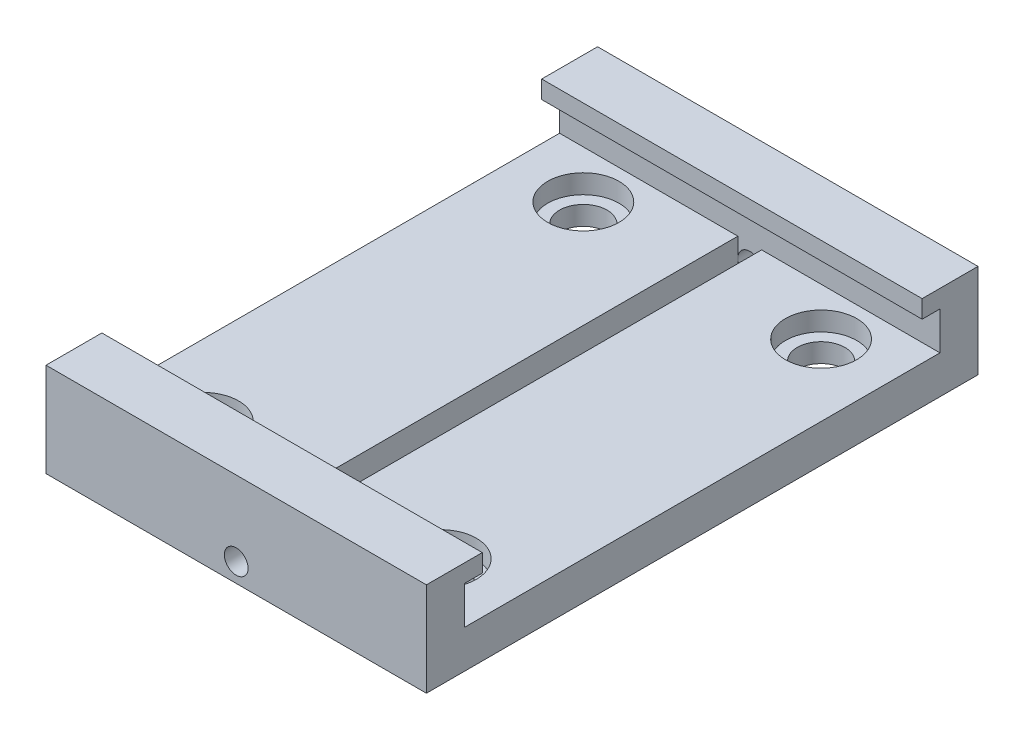
ISO-10303-21;
HEADER;
FILE_DESCRIPTION(('STEP AP214'),'2;1');
FILE_NAME('part.step','',(''),(''),'','','');
FILE_SCHEMA(('AUTOMOTIVE_DESIGN { 1 0 10303 214 1 1 1 1 }'));
ENDSEC;
DATA;
#1=APPLICATION_CONTEXT('core data for automotive mechanical design processes');
#2=APPLICATION_PROTOCOL_DEFINITION('international standard','automotive_design',2000,#1);
#3=PRODUCT_CONTEXT('',#1,'mechanical');
#4=PRODUCT('Part','Part','',(#3));
#5=PRODUCT_RELATED_PRODUCT_CATEGORY('part','',(#4));
#6=PRODUCT_DEFINITION_FORMATION('','',#4);
#7=PRODUCT_DEFINITION_CONTEXT('part definition',#1,'design');
#8=PRODUCT_DEFINITION('design','',#6,#7);
#9=PRODUCT_DEFINITION_SHAPE('','',#8);
#10=(LENGTH_UNIT() NAMED_UNIT(*) SI_UNIT(.MILLI.,.METRE.));
#11=(NAMED_UNIT(*) PLANE_ANGLE_UNIT() SI_UNIT($,.RADIAN.));
#12=(NAMED_UNIT(*) SI_UNIT($,.STERADIAN.) SOLID_ANGLE_UNIT());
#13=UNCERTAINTY_MEASURE_WITH_UNIT(LENGTH_MEASURE(1.E-05),#10,'distance_accuracy_value','');
#14=(GEOMETRIC_REPRESENTATION_CONTEXT(3) GLOBAL_UNCERTAINTY_ASSIGNED_CONTEXT((#13)) GLOBAL_UNIT_ASSIGNED_CONTEXT((#10,
#11,#12)) REPRESENTATION_CONTEXT('',''));
#15=CARTESIAN_POINT('',(0.,0.,0.));
#16=DIRECTION('',(0.,0.,1.));
#17=DIRECTION('',(1.,0.,0.));
#18=AXIS2_PLACEMENT_3D('',#15,#16,#17);
#19=CARTESIAN_POINT('',(-25.4,0.,-31.75));
#20=DIRECTION('',(0.,0.,1.));
#21=DIRECTION('',(1.,0.,0.));
#22=AXIS2_PLACEMENT_3D('',#19,#20,#21);
#23=PLANE('',#22);
#24=DIRECTION('',(0.,1.,0.));
#25=VECTOR('',#24,1.);
#26=CARTESIAN_POINT('',(1.5875,0.,-31.75));
#27=LINE('',#26,#25);
#28=CARTESIAN_POINT('',(1.5875,0.,-31.75));
#29=VERTEX_POINT('',#28);
#30=CARTESIAN_POINT('',(1.5875,2.54,-31.75));
#31=VERTEX_POINT('',#30);
#32=EDGE_CURVE('E170',#29,#31,#27,.T.);
#33=ORIENTED_EDGE('',*,*,#32,.T.);
#34=CARTESIAN_POINT('',(0.,2.54,-31.75));
#35=DIRECTION('',(0.,0.,1.));
#36=DIRECTION('',(1.,0.,0.));
#37=AXIS2_PLACEMENT_3D('',#34,#35,#36);
#38=CIRCLE('',#37,1.5875);
#39=CARTESIAN_POINT('',(-1.5875,2.54,-31.75));
#40=VERTEX_POINT('',#39);
#41=EDGE_CURVE('E50',#31,#40,#38,.F.);
#42=ORIENTED_EDGE('',*,*,#41,.T.);
#43=DIRECTION('',(0.,1.,0.));
#44=VECTOR('',#43,1.);
#45=CARTESIAN_POINT('',(-1.5875,0.,-31.75));
#46=LINE('',#45,#44);
#47=CARTESIAN_POINT('',(-1.5875,0.,-31.75));
#48=VERTEX_POINT('',#47);
#49=EDGE_CURVE('E168',#48,#40,#46,.T.);
#50=ORIENTED_EDGE('',*,*,#49,.F.);
#51=DIRECTION('',(-1.,0.,0.));
#52=VECTOR('',#51,1.);
#53=CARTESIAN_POINT('',(-1.5875,0.,-31.75));
#54=LINE('',#53,#52);
#55=EDGE_CURVE('E319',#29,#48,#54,.T.);
#56=ORIENTED_EDGE('',*,*,#55,.F.);
#57=EDGE_LOOP('',(#33,#42,#50,#56));
#58=FACE_BOUND('',#57,.T.);
#59=ADVANCED_FACE('F34',(#58),#23,.T.);
#60=CARTESIAN_POINT('',(-25.4,0.,31.75));
#61=DIRECTION('',(0.,0.,1.));
#62=DIRECTION('',(1.,0.,0.));
#63=AXIS2_PLACEMENT_3D('',#60,#61,#62);
#64=PLANE('',#63);
#65=DIRECTION('',(0.,1.,0.));
#66=VECTOR('',#65,1.);
#67=CARTESIAN_POINT('',(1.58750000000001,0.,31.75));
#68=LINE('',#67,#66);
#69=CARTESIAN_POINT('',(1.58750000000001,2.54,31.75));
#70=VERTEX_POINT('',#69);
#71=CARTESIAN_POINT('',(1.58750000000001,5.08,31.75));
#72=VERTEX_POINT('',#71);
#73=EDGE_CURVE('E197',#70,#72,#68,.T.);
#74=ORIENTED_EDGE('',*,*,#73,.F.);
#75=CARTESIAN_POINT('',(0.,2.54,31.75));
#76=DIRECTION('',(0.,0.,1.));
#77=DIRECTION('',(1.,0.,0.));
#78=AXIS2_PLACEMENT_3D('',#75,#76,#77);
#79=CIRCLE('',#78,1.5875);
#80=CARTESIAN_POINT('',(-1.58750000000001,2.54,31.75));
#81=VERTEX_POINT('',#80);
#82=EDGE_CURVE('E57',#81,#70,#79,.F.);
#83=ORIENTED_EDGE('',*,*,#82,.F.);
#84=DIRECTION('',(0.,1.,0.));
#85=VECTOR('',#84,1.);
#86=CARTESIAN_POINT('',(-1.58750000000001,0.,31.75));
#87=LINE('',#86,#85);
#88=CARTESIAN_POINT('',(-1.58750000000001,5.08,31.75));
#89=VERTEX_POINT('',#88);
#90=EDGE_CURVE('E201',#81,#89,#87,.T.);
#91=ORIENTED_EDGE('',*,*,#90,.T.);
#92=DIRECTION('',(1.,0.,0.));
#93=VECTOR('',#92,1.);
#94=CARTESIAN_POINT('',(-25.4,5.08,31.75));
#95=LINE('',#94,#93);
#96=CARTESIAN_POINT('',(-25.4,5.08,31.75));
#97=VERTEX_POINT('',#96);
#98=EDGE_CURVE('E251',#97,#89,#95,.T.);
#99=ORIENTED_EDGE('',*,*,#98,.F.);
#100=DIRECTION('',(0.,-1.,0.));
#101=VECTOR('',#100,1.);
#102=CARTESIAN_POINT('',(-25.4,0.,31.75));
#103=LINE('',#102,#101);
#104=CARTESIAN_POINT('',(-25.4,10.16,31.75));
#105=VERTEX_POINT('',#104);
#106=EDGE_CURVE('E224',#105,#97,#103,.T.);
#107=ORIENTED_EDGE('',*,*,#106,.F.);
#108=DIRECTION('',(1.,0.,0.));
#109=VECTOR('',#108,1.);
#110=CARTESIAN_POINT('',(-25.4,10.16,31.75));
#111=LINE('',#110,#109);
#112=CARTESIAN_POINT('',(25.4,10.16,31.75));
#113=VERTEX_POINT('',#112);
#114=EDGE_CURVE('E255',#105,#113,#111,.T.);
#115=ORIENTED_EDGE('',*,*,#114,.T.);
#116=DIRECTION('',(0.,-1.,0.));
#117=VECTOR('',#116,1.);
#118=CARTESIAN_POINT('',(25.4,0.,31.75));
#119=LINE('',#118,#117);
#120=CARTESIAN_POINT('',(25.4,5.08,31.75));
#121=VERTEX_POINT('',#120);
#122=EDGE_CURVE('E243',#113,#121,#119,.T.);
#123=ORIENTED_EDGE('',*,*,#122,.T.);
#124=EDGE_CURVE('E254',#72,#121,#95,.T.);
#125=ORIENTED_EDGE('',*,*,#124,.F.);
#126=EDGE_LOOP('',(#74,#83,#91,#99,#107,#115,#123,#125));
#127=FACE_BOUND('',#126,.T.);
#128=ADVANCED_FACE('F354',(#127),#64,.F.);
#129=CARTESIAN_POINT('',(15.875,0.,-25.4));
#130=DIRECTION('',(0.,1.,0.));
#131=DIRECTION('',(0.,0.,1.));
#132=AXIS2_PLACEMENT_3D('',#129,#130,#131);
#133=CYLINDRICAL_SURFACE('',#132,3.175);
#134=CARTESIAN_POINT('',(15.875,0.,-25.4));
#135=DIRECTION('',(0.,1.,0.));
#136=DIRECTION('',(0.,0.,1.));
#137=AXIS2_PLACEMENT_3D('',#134,#135,#136);
#138=CIRCLE('',#137,3.175);
#139=CARTESIAN_POINT('',(15.875,0.,-22.225));
#140=VERTEX_POINT('',#139);
#141=EDGE_CURVE('E308',#140,#140,#138,.T.);
#142=ORIENTED_EDGE('',*,*,#141,.F.);
#143=EDGE_LOOP('',(#142));
#144=FACE_BOUND('',#143,.T.);
#145=CARTESIAN_POINT('',(15.875,2.54,-25.4));
#146=DIRECTION('',(0.,1.,0.));
#147=DIRECTION('',(0.,0.,1.));
#148=AXIS2_PLACEMENT_3D('',#145,#146,#147);
#149=CIRCLE('',#148,3.175);
#150=CARTESIAN_POINT('',(15.875,2.54,-22.225));
#151=VERTEX_POINT('',#150);
#152=EDGE_CURVE('E38',#151,#151,#149,.F.);
#153=ORIENTED_EDGE('',*,*,#152,.F.);
#154=EDGE_LOOP('',(#153));
#155=FACE_BOUND('',#154,.T.);
#156=ADVANCED_FACE('F408',(#144,#155),#133,.F.);
#157=CARTESIAN_POINT('',(15.875,0.,25.4));
#158=DIRECTION('',(0.,1.,0.));
#159=DIRECTION('',(0.,0.,1.));
#160=AXIS2_PLACEMENT_3D('',#157,#158,#159);
#161=CYLINDRICAL_SURFACE('',#160,3.175);
#162=CARTESIAN_POINT('',(15.875,0.,25.4));
#163=DIRECTION('',(0.,1.,0.));
#164=DIRECTION('',(0.,0.,1.));
#165=AXIS2_PLACEMENT_3D('',#162,#163,#164);
#166=CIRCLE('',#165,3.175);
#167=CARTESIAN_POINT('',(15.875,0.,28.575));
#168=VERTEX_POINT('',#167);
#169=EDGE_CURVE('E295',#168,#168,#166,.T.);
#170=ORIENTED_EDGE('',*,*,#169,.F.);
#171=EDGE_LOOP('',(#170));
#172=FACE_BOUND('',#171,.T.);
#173=CARTESIAN_POINT('',(15.875,2.54,25.4));
#174=DIRECTION('',(0.,1.,0.));
#175=DIRECTION('',(0.,0.,1.));
#176=AXIS2_PLACEMENT_3D('',#173,#174,#175);
#177=CIRCLE('',#176,3.175);
#178=CARTESIAN_POINT('',(15.875,2.54,28.575));
#179=VERTEX_POINT('',#178);
#180=EDGE_CURVE('E290',#179,#179,#177,.F.);
#181=ORIENTED_EDGE('',*,*,#180,.F.);
#182=EDGE_LOOP('',(#181));
#183=FACE_BOUND('',#182,.T.);
#184=ADVANCED_FACE('F454',(#172,#183),#161,.F.);
#185=CARTESIAN_POINT('',(-15.875,0.,-25.4));
#186=DIRECTION('',(0.,1.,0.));
#187=DIRECTION('',(0.,0.,1.));
#188=AXIS2_PLACEMENT_3D('',#185,#186,#187);
#189=CYLINDRICAL_SURFACE('',#188,3.175);
#190=CARTESIAN_POINT('',(-15.875,0.,-25.4));
#191=DIRECTION('',(0.,1.,0.));
#192=DIRECTION('',(0.,0.,1.));
#193=AXIS2_PLACEMENT_3D('',#190,#191,#192);
#194=CIRCLE('',#193,3.175);
#195=CARTESIAN_POINT('',(-15.875,0.,-22.225));
#196=VERTEX_POINT('',#195);
#197=EDGE_CURVE('E304',#196,#196,#194,.T.);
#198=ORIENTED_EDGE('',*,*,#197,.F.);
#199=EDGE_LOOP('',(#198));
#200=FACE_BOUND('',#199,.T.);
#201=CARTESIAN_POINT('',(-15.875,2.54,-25.4));
#202=DIRECTION('',(0.,1.,0.));
#203=DIRECTION('',(0.,0.,1.));
#204=AXIS2_PLACEMENT_3D('',#201,#202,#203);
#205=CIRCLE('',#204,3.175);
#206=CARTESIAN_POINT('',(-15.875,2.54,-22.225));
#207=VERTEX_POINT('',#206);
#208=EDGE_CURVE('E287',#207,#207,#205,.F.);
#209=ORIENTED_EDGE('',*,*,#208,.F.);
#210=EDGE_LOOP('',(#209));
#211=FACE_BOUND('',#210,.T.);
#212=ADVANCED_FACE('F429',(#200,#211),#189,.F.);
#213=CARTESIAN_POINT('',(-15.875,0.,25.4));
#214=DIRECTION('',(0.,1.,0.));
#215=DIRECTION('',(0.,0.,1.));
#216=AXIS2_PLACEMENT_3D('',#213,#214,#215);
#217=CYLINDRICAL_SURFACE('',#216,3.175);
#218=CARTESIAN_POINT('',(-15.875,0.,25.4));
#219=DIRECTION('',(0.,1.,0.));
#220=DIRECTION('',(0.,0.,1.));
#221=AXIS2_PLACEMENT_3D('',#218,#219,#220);
#222=CIRCLE('',#221,3.175);
#223=CARTESIAN_POINT('',(-15.875,0.,28.575));
#224=VERTEX_POINT('',#223);
#225=EDGE_CURVE('E299',#224,#224,#222,.T.);
#226=ORIENTED_EDGE('',*,*,#225,.F.);
#227=EDGE_LOOP('',(#226));
#228=FACE_BOUND('',#227,.T.);
#229=CARTESIAN_POINT('',(-15.875,2.54,25.4));
#230=DIRECTION('',(0.,1.,0.));
#231=DIRECTION('',(0.,0.,1.));
#232=AXIS2_PLACEMENT_3D('',#229,#230,#231);
#233=CIRCLE('',#232,3.175);
#234=CARTESIAN_POINT('',(-15.875,2.54,28.575));
#235=VERTEX_POINT('',#234);
#236=EDGE_CURVE('E284',#235,#235,#233,.F.);
#237=ORIENTED_EDGE('',*,*,#236,.F.);
#238=EDGE_LOOP('',(#237));
#239=FACE_BOUND('',#238,.T.);
#240=ADVANCED_FACE('F423',(#228,#239),#217,.F.);
#241=CARTESIAN_POINT('',(-25.4,5.08,0.));
#242=DIRECTION('',(0.,-1.,0.));
#243=DIRECTION('',(0.,0.,-1.));
#244=AXIS2_PLACEMENT_3D('',#241,#242,#243);
#245=PLANE('',#244);
#246=CARTESIAN_POINT('',(-15.875,5.08,25.4));
#247=DIRECTION('',(0.,1.,0.));
#248=DIRECTION('',(0.,0.,1.));
#249=AXIS2_PLACEMENT_3D('',#246,#247,#248);
#250=CIRCLE('',#249,4.7625);
#251=CARTESIAN_POINT('',(-15.875,5.08,30.1625));
#252=VERTEX_POINT('',#251);
#253=EDGE_CURVE('E435',#252,#252,#250,.T.);
#254=ORIENTED_EDGE('',*,*,#253,.F.);
#255=EDGE_LOOP('',(#254));
#256=FACE_BOUND('',#255,.T.);
#257=CARTESIAN_POINT('',(-15.875,5.08,-25.4));
#258=DIRECTION('',(0.,1.,0.));
#259=DIRECTION('',(0.,0.,1.));
#260=AXIS2_PLACEMENT_3D('',#257,#258,#259);
#261=CIRCLE('',#260,4.7625);
#262=CARTESIAN_POINT('',(-15.875,5.08,-20.6375));
#263=VERTEX_POINT('',#262);
#264=EDGE_CURVE('E438',#263,#263,#261,.T.);
#265=ORIENTED_EDGE('',*,*,#264,.F.);
#266=EDGE_LOOP('',(#265));
#267=FACE_BOUND('',#266,.T.);
#268=ORIENTED_EDGE('',*,*,#98,.T.);
#269=DIRECTION('',(0.,0.,1.));
#270=VECTOR('',#269,1.);
#271=CARTESIAN_POINT('',(-1.5875,5.08,-31.75));
#272=LINE('',#271,#270);
#273=CARTESIAN_POINT('',(-1.5875,5.08,-31.75));
#274=VERTEX_POINT('',#273);
#275=EDGE_CURVE('E311',#274,#89,#272,.T.);
#276=ORIENTED_EDGE('',*,*,#275,.F.);
#277=DIRECTION('',(1.,0.,0.));
#278=VECTOR('',#277,1.);
#279=CARTESIAN_POINT('',(-25.4,5.08,-31.75));
#280=LINE('',#279,#278);
#281=CARTESIAN_POINT('',(-25.4,5.08,-31.75));
#282=VERTEX_POINT('',#281);
#283=EDGE_CURVE('E176',#282,#274,#280,.T.);
#284=ORIENTED_EDGE('',*,*,#283,.F.);
#285=DIRECTION('',(0.,0.,-1.));
#286=VECTOR('',#285,1.);
#287=CARTESIAN_POINT('',(-25.4,5.08,0.));
#288=LINE('',#287,#286);
#289=EDGE_CURVE('E227',#97,#282,#288,.T.);
#290=ORIENTED_EDGE('',*,*,#289,.F.);
#291=EDGE_LOOP('',(#268,#276,#284,#290));
#292=FACE_BOUND('',#291,.T.);
#293=ADVANCED_FACE('F351',(#256,#267,#292),#245,.F.);
#294=CARTESIAN_POINT('',(-25.4,25.4,-36.83));
#295=DIRECTION('',(1.,0.,0.));
#296=DIRECTION('',(0.,0.,-1.));
#297=AXIS2_PLACEMENT_3D('',#294,#295,#296);
#298=PLANE('',#297);
#299=DIRECTION('',(0.,-1.,0.));
#300=VECTOR('',#299,1.);
#301=CARTESIAN_POINT('',(-25.4,25.4,36.83));
#302=LINE('',#301,#300);
#303=CARTESIAN_POINT('',(-25.4,12.54125,36.83));
#304=VERTEX_POINT('',#303);
#305=CARTESIAN_POINT('',(-25.4,0.,36.83));
#306=VERTEX_POINT('',#305);
#307=EDGE_CURVE('E11',#304,#306,#302,.T.);
#308=ORIENTED_EDGE('',*,*,#307,.F.);
#309=DIRECTION('',(0.,0.,-1.));
#310=VECTOR('',#309,1.);
#311=CARTESIAN_POINT('',(-25.4,12.54125,36.83));
#312=LINE('',#311,#310);
#313=CARTESIAN_POINT('',(-25.4,12.54125,29.36875));
#314=VERTEX_POINT('',#313);
#315=EDGE_CURVE('E202',#304,#314,#312,.T.);
#316=ORIENTED_EDGE('',*,*,#315,.T.);
#317=DIRECTION('',(0.,1.,0.));
#318=VECTOR('',#317,1.);
#319=CARTESIAN_POINT('',(-25.4,0.,29.36875));
#320=LINE('',#319,#318);
#321=CARTESIAN_POINT('',(-25.4,10.16,29.36875));
#322=VERTEX_POINT('',#321);
#323=EDGE_CURVE('E221',#322,#314,#320,.T.);
#324=ORIENTED_EDGE('',*,*,#323,.F.);
#325=DIRECTION('',(0.,0.,-1.));
#326=VECTOR('',#325,1.);
#327=CARTESIAN_POINT('',(-25.4,10.16,0.));
#328=LINE('',#327,#326);
#329=EDGE_CURVE('E218',#105,#322,#328,.T.);
#330=ORIENTED_EDGE('',*,*,#329,.F.);
#331=ORIENTED_EDGE('',*,*,#106,.T.);
#332=ORIENTED_EDGE('',*,*,#289,.T.);
#333=DIRECTION('',(0.,-1.,0.));
#334=VECTOR('',#333,1.);
#335=CARTESIAN_POINT('',(-25.4,0.,-31.75));
#336=LINE('',#335,#334);
#337=CARTESIAN_POINT('',(-25.4,10.16,-31.75));
#338=VERTEX_POINT('',#337);
#339=EDGE_CURVE('E212',#338,#282,#336,.T.);
#340=ORIENTED_EDGE('',*,*,#339,.F.);
#341=CARTESIAN_POINT('',(-25.4,10.16,-29.36875));
#342=VERTEX_POINT('',#341);
#343=EDGE_CURVE('E214',#342,#338,#328,.T.);
#344=ORIENTED_EDGE('',*,*,#343,.F.);
#345=DIRECTION('',(0.,1.,0.));
#346=VECTOR('',#345,1.);
#347=CARTESIAN_POINT('',(-25.4,0.,-29.36875));
#348=LINE('',#347,#346);
#349=CARTESIAN_POINT('',(-25.4,12.54125,-29.36875));
#350=VERTEX_POINT('',#349);
#351=EDGE_CURVE('E217',#342,#350,#348,.T.);
#352=ORIENTED_EDGE('',*,*,#351,.T.);
#353=CARTESIAN_POINT('',(-25.4,12.54125,-36.83));
#354=VERTEX_POINT('',#353);
#355=EDGE_CURVE('E205',#350,#354,#312,.T.);
#356=ORIENTED_EDGE('',*,*,#355,.T.);
#357=DIRECTION('',(0.,-1.,0.));
#358=VECTOR('',#357,1.);
#359=CARTESIAN_POINT('',(-25.4,25.4,-36.83));
#360=LINE('',#359,#358);
#361=CARTESIAN_POINT('',(-25.4,0.,-36.83));
#362=VERTEX_POINT('',#361);
#363=EDGE_CURVE('E279',#354,#362,#360,.T.);
#364=ORIENTED_EDGE('',*,*,#363,.T.);
#365=DIRECTION('',(0.,0.,1.));
#366=VECTOR('',#365,1.);
#367=CARTESIAN_POINT('',(-25.4,0.,-36.83));
#368=LINE('',#367,#366);
#369=EDGE_CURVE('E249',#362,#306,#368,.T.);
#370=ORIENTED_EDGE('',*,*,#369,.T.);
#371=EDGE_LOOP('',(#308,#316,#324,#330,#331,#332,#340,#344,#352,#356,#364,#370));
#372=FACE_BOUND('',#371,.T.);
#373=ADVANCED_FACE('F36',(#372),#298,.F.);
#374=CARTESIAN_POINT('',(25.4,25.4,-36.83));
#375=DIRECTION('',(-1.,0.,0.));
#376=DIRECTION('',(0.,0.,1.));
#377=AXIS2_PLACEMENT_3D('',#374,#375,#376);
#378=PLANE('',#377);
#379=DIRECTION('',(0.,-1.,0.));
#380=VECTOR('',#379,1.);
#381=CARTESIAN_POINT('',(25.4,25.4,-36.83));
#382=LINE('',#381,#380);
#383=CARTESIAN_POINT('',(25.4,12.54125,-36.83));
#384=VERTEX_POINT('',#383);
#385=CARTESIAN_POINT('',(25.4,0.,-36.83));
#386=VERTEX_POINT('',#385);
#387=EDGE_CURVE('E281',#384,#386,#382,.T.);
#388=ORIENTED_EDGE('',*,*,#387,.F.);
#389=DIRECTION('',(0.,0.,-1.));
#390=VECTOR('',#389,1.);
#391=CARTESIAN_POINT('',(25.4,12.54125,36.83));
#392=LINE('',#391,#390);
#393=CARTESIAN_POINT('',(25.4,12.54125,-29.36875));
#394=VERTEX_POINT('',#393);
#395=EDGE_CURVE('E185',#394,#384,#392,.T.);
#396=ORIENTED_EDGE('',*,*,#395,.F.);
#397=DIRECTION('',(0.,1.,0.));
#398=VECTOR('',#397,1.);
#399=CARTESIAN_POINT('',(25.4,0.,-29.36875));
#400=LINE('',#399,#398);
#401=CARTESIAN_POINT('',(25.4,10.16,-29.36875));
#402=VERTEX_POINT('',#401);
#403=EDGE_CURVE('E236',#402,#394,#400,.T.);
#404=ORIENTED_EDGE('',*,*,#403,.F.);
#405=DIRECTION('',(0.,0.,-1.));
#406=VECTOR('',#405,1.);
#407=CARTESIAN_POINT('',(25.4,10.16,0.));
#408=LINE('',#407,#406);
#409=CARTESIAN_POINT('',(25.4,10.16,-31.75));
#410=VERTEX_POINT('',#409);
#411=EDGE_CURVE('E233',#402,#410,#408,.T.);
#412=ORIENTED_EDGE('',*,*,#411,.T.);
#413=DIRECTION('',(0.,-1.,0.));
#414=VECTOR('',#413,1.);
#415=CARTESIAN_POINT('',(25.4,0.,-31.75));
#416=LINE('',#415,#414);
#417=CARTESIAN_POINT('',(25.4,5.08,-31.75));
#418=VERTEX_POINT('',#417);
#419=EDGE_CURVE('E210',#410,#418,#416,.T.);
#420=ORIENTED_EDGE('',*,*,#419,.T.);
#421=DIRECTION('',(0.,0.,-1.));
#422=VECTOR('',#421,1.);
#423=CARTESIAN_POINT('',(25.4,5.08,0.));
#424=LINE('',#423,#422);
#425=EDGE_CURVE('E215',#121,#418,#424,.T.);
#426=ORIENTED_EDGE('',*,*,#425,.F.);
#427=ORIENTED_EDGE('',*,*,#122,.F.);
#428=CARTESIAN_POINT('',(25.4,10.16,29.36875));
#429=VERTEX_POINT('',#428);
#430=EDGE_CURVE('E237',#113,#429,#408,.T.);
#431=ORIENTED_EDGE('',*,*,#430,.T.);
#432=DIRECTION('',(0.,1.,0.));
#433=VECTOR('',#432,1.);
#434=CARTESIAN_POINT('',(25.4,0.,29.36875));
#435=LINE('',#434,#433);
#436=CARTESIAN_POINT('',(25.4,12.54125,29.36875));
#437=VERTEX_POINT('',#436);
#438=EDGE_CURVE('E240',#429,#437,#435,.T.);
#439=ORIENTED_EDGE('',*,*,#438,.T.);
#440=CARTESIAN_POINT('',(25.4,12.54125,36.83));
#441=VERTEX_POINT('',#440);
#442=EDGE_CURVE('E186',#441,#437,#392,.T.);
#443=ORIENTED_EDGE('',*,*,#442,.F.);
#444=DIRECTION('',(0.,-1.,0.));
#445=VECTOR('',#444,1.);
#446=CARTESIAN_POINT('',(25.4,25.4,36.83));
#447=LINE('',#446,#445);
#448=CARTESIAN_POINT('',(25.4,0.,36.83));
#449=VERTEX_POINT('',#448);
#450=EDGE_CURVE('E43',#441,#449,#447,.T.);
#451=ORIENTED_EDGE('',*,*,#450,.T.);
#452=DIRECTION('',(0.,0.,-1.));
#453=VECTOR('',#452,1.);
#454=CARTESIAN_POINT('',(25.4,0.,-36.83));
#455=LINE('',#454,#453);
#456=EDGE_CURVE('E273',#449,#386,#455,.T.);
#457=ORIENTED_EDGE('',*,*,#456,.T.);
#458=EDGE_LOOP('',(#388,#396,#404,#412,#420,#426,#427,#431,#439,#443,#451,#457));
#459=FACE_BOUND('',#458,.T.);
#460=ADVANCED_FACE('F341',(#459),#378,.F.);
#461=CARTESIAN_POINT('',(25.4,25.4,36.83));
#462=DIRECTION('',(0.,0.,-1.));
#463=DIRECTION('',(-1.,0.,0.));
#464=AXIS2_PLACEMENT_3D('',#461,#462,#463);
#465=PLANE('',#464);
#466=CARTESIAN_POINT('',(0.,2.54,36.83));
#467=DIRECTION('',(0.,0.,1.));
#468=DIRECTION('',(1.,0.,0.));
#469=AXIS2_PLACEMENT_3D('',#466,#467,#468);
#470=CIRCLE('',#469,1.5875);
#471=CARTESIAN_POINT('',(1.58750000000001,2.54,36.83));
#472=VERTEX_POINT('',#471);
#473=EDGE_CURVE('E171',#472,#472,#470,.T.);
#474=ORIENTED_EDGE('',*,*,#473,.F.);
#475=EDGE_LOOP('',(#474));
#476=FACE_BOUND('',#475,.T.);
#477=ORIENTED_EDGE('',*,*,#450,.F.);
#478=DIRECTION('',(1.,0.,0.));
#479=VECTOR('',#478,1.);
#480=CARTESIAN_POINT('',(-25.4,12.54125,36.83));
#481=LINE('',#480,#479);
#482=EDGE_CURVE('E204',#304,#441,#481,.T.);
#483=ORIENTED_EDGE('',*,*,#482,.F.);
#484=ORIENTED_EDGE('',*,*,#307,.T.);
#485=DIRECTION('',(1.,0.,0.));
#486=VECTOR('',#485,1.);
#487=CARTESIAN_POINT('',(25.4,0.,36.83));
#488=LINE('',#487,#486);
#489=EDGE_CURVE('E270',#306,#449,#488,.T.);
#490=ORIENTED_EDGE('',*,*,#489,.T.);
#491=EDGE_LOOP('',(#477,#483,#484,#490));
#492=FACE_BOUND('',#491,.T.);
#493=ADVANCED_FACE('F377',(#476,#492),#465,.F.);
#494=CARTESIAN_POINT('',(25.4,25.4,-36.83));
#495=DIRECTION('',(0.,0.,1.));
#496=DIRECTION('',(1.,0.,0.));
#497=AXIS2_PLACEMENT_3D('',#494,#495,#496);
#498=PLANE('',#497);
#499=CARTESIAN_POINT('',(0.,2.54,-36.83));
#500=DIRECTION('',(0.,0.,1.));
#501=DIRECTION('',(1.,0.,0.));
#502=AXIS2_PLACEMENT_3D('',#499,#500,#501);
#503=CIRCLE('',#502,1.5875);
#504=CARTESIAN_POINT('',(1.58750000000001,2.54,-36.83));
#505=VERTEX_POINT('',#504);
#506=EDGE_CURVE('E162',#505,#505,#503,.T.);
#507=ORIENTED_EDGE('',*,*,#506,.T.);
#508=EDGE_LOOP('',(#507));
#509=FACE_BOUND('',#508,.T.);
#510=ORIENTED_EDGE('',*,*,#363,.F.);
#511=DIRECTION('',(1.,0.,0.));
#512=VECTOR('',#511,1.);
#513=CARTESIAN_POINT('',(-25.4,12.54125,-36.83));
#514=LINE('',#513,#512);
#515=EDGE_CURVE('E207',#354,#384,#514,.T.);
#516=ORIENTED_EDGE('',*,*,#515,.T.);
#517=ORIENTED_EDGE('',*,*,#387,.T.);
#518=DIRECTION('',(-1.,0.,0.));
#519=VECTOR('',#518,1.);
#520=CARTESIAN_POINT('',(25.4,0.,-36.83));
#521=LINE('',#520,#519);
#522=EDGE_CURVE('E276',#386,#362,#521,.T.);
#523=ORIENTED_EDGE('',*,*,#522,.T.);
#524=EDGE_LOOP('',(#510,#516,#517,#523));
#525=FACE_BOUND('',#524,.T.);
#526=ADVANCED_FACE('F365',(#509,#525),#498,.F.);
#527=CARTESIAN_POINT('',(0.,0.,0.));
#528=DIRECTION('',(0.,-1.,0.));
#529=DIRECTION('',(0.,0.,-1.));
#530=AXIS2_PLACEMENT_3D('',#527,#528,#529);
#531=PLANE('',#530);
#532=ORIENTED_EDGE('',*,*,#169,.T.);
#533=EDGE_LOOP('',(#532));
#534=FACE_BOUND('',#533,.T.);
#535=ORIENTED_EDGE('',*,*,#225,.T.);
#536=EDGE_LOOP('',(#535));
#537=FACE_BOUND('',#536,.T.);
#538=ORIENTED_EDGE('',*,*,#197,.T.);
#539=EDGE_LOOP('',(#538));
#540=FACE_BOUND('',#539,.T.);
#541=ORIENTED_EDGE('',*,*,#141,.T.);
#542=EDGE_LOOP('',(#541));
#543=FACE_BOUND('',#542,.T.);
#544=DIRECTION('',(0.,0.,1.));
#545=VECTOR('',#544,1.);
#546=CARTESIAN_POINT('',(-1.5875,0.,-31.75));
#547=LINE('',#546,#545);
#548=CARTESIAN_POINT('',(-1.58750000000001,0.,31.75));
#549=VERTEX_POINT('',#548);
#550=EDGE_CURVE('E183',#48,#549,#547,.T.);
#551=ORIENTED_EDGE('',*,*,#550,.T.);
#552=DIRECTION('',(1.,0.,0.));
#553=VECTOR('',#552,1.);
#554=CARTESIAN_POINT('',(-1.58750000000001,0.,31.75));
#555=LINE('',#554,#553);
#556=CARTESIAN_POINT('',(1.58750000000001,0.,31.75));
#557=VERTEX_POINT('',#556);
#558=EDGE_CURVE('E313',#549,#557,#555,.T.);
#559=ORIENTED_EDGE('',*,*,#558,.T.);
#560=DIRECTION('',(0.,0.,-1.));
#561=VECTOR('',#560,1.);
#562=CARTESIAN_POINT('',(1.5875,0.,-31.75));
#563=LINE('',#562,#561);
#564=EDGE_CURVE('E316',#557,#29,#563,.T.);
#565=ORIENTED_EDGE('',*,*,#564,.T.);
#566=ORIENTED_EDGE('',*,*,#55,.T.);
#567=EDGE_LOOP('',(#551,#559,#565,#566));
#568=FACE_BOUND('',#567,.T.);
#569=ORIENTED_EDGE('',*,*,#369,.F.);
#570=ORIENTED_EDGE('',*,*,#522,.F.);
#571=ORIENTED_EDGE('',*,*,#456,.F.);
#572=ORIENTED_EDGE('',*,*,#489,.F.);
#573=EDGE_LOOP('',(#569,#570,#571,#572));
#574=FACE_BOUND('',#573,.T.);
#575=ADVANCED_FACE('F362',(#534,#537,#540,#543,#568,#574),#531,.T.);
#576=EDGE_CURVE('E173',#40,#274,#46,.T.);
#577=ORIENTED_EDGE('',*,*,#576,.F.);
#578=EDGE_CURVE('E157',#40,#31,#38,.F.);
#579=ORIENTED_EDGE('',*,*,#578,.T.);
#580=CARTESIAN_POINT('',(1.5875,5.08,-31.75));
#581=VERTEX_POINT('',#580);
#582=EDGE_CURVE('E193',#31,#581,#27,.T.);
#583=ORIENTED_EDGE('',*,*,#582,.T.);
#584=EDGE_CURVE('E250',#581,#418,#280,.T.);
#585=ORIENTED_EDGE('',*,*,#584,.T.);
#586=ORIENTED_EDGE('',*,*,#419,.F.);
#587=DIRECTION('',(1.,0.,0.));
#588=VECTOR('',#587,1.);
#589=CARTESIAN_POINT('',(-25.4,10.16,-31.75));
#590=LINE('',#589,#588);
#591=EDGE_CURVE('E230',#338,#410,#590,.T.);
#592=ORIENTED_EDGE('',*,*,#591,.F.);
#593=ORIENTED_EDGE('',*,*,#339,.T.);
#594=ORIENTED_EDGE('',*,*,#283,.T.);
#595=EDGE_LOOP('',(#577,#579,#583,#585,#586,#592,#593,#594));
#596=FACE_BOUND('',#595,.T.);
#597=ADVANCED_FACE('F174',(#596),#23,.T.);
#598=CARTESIAN_POINT('',(15.875,5.08,-25.4));
#599=DIRECTION('',(0.,1.,0.));
#600=DIRECTION('',(0.,0.,1.));
#601=AXIS2_PLACEMENT_3D('',#598,#599,#600);
#602=CIRCLE('',#601,4.7625);
#603=CARTESIAN_POINT('',(15.875,5.08,-20.6375));
#604=VERTEX_POINT('',#603);
#605=EDGE_CURVE('E679',#604,#604,#602,.T.);
#606=ORIENTED_EDGE('',*,*,#605,.F.);
#607=EDGE_LOOP('',(#606));
#608=FACE_BOUND('',#607,.T.);
#609=CARTESIAN_POINT('',(15.875,5.08,25.4));
#610=DIRECTION('',(0.,1.,0.));
#611=DIRECTION('',(0.,0.,1.));
#612=AXIS2_PLACEMENT_3D('',#609,#610,#611);
#613=CIRCLE('',#612,4.7625);
#614=CARTESIAN_POINT('',(15.875,5.08,30.1625));
#615=VERTEX_POINT('',#614);
#616=EDGE_CURVE('E685',#615,#615,#613,.T.);
#617=ORIENTED_EDGE('',*,*,#616,.F.);
#618=EDGE_LOOP('',(#617));
#619=FACE_BOUND('',#618,.T.);
#620=ORIENTED_EDGE('',*,*,#584,.F.);
#621=DIRECTION('',(0.,0.,-1.));
#622=VECTOR('',#621,1.);
#623=CARTESIAN_POINT('',(1.5875,5.08,-31.75));
#624=LINE('',#623,#622);
#625=EDGE_CURVE('E190',#72,#581,#624,.T.);
#626=ORIENTED_EDGE('',*,*,#625,.F.);
#627=ORIENTED_EDGE('',*,*,#124,.T.);
#628=ORIENTED_EDGE('',*,*,#425,.T.);
#629=EDGE_LOOP('',(#620,#626,#627,#628));
#630=FACE_BOUND('',#629,.T.);
#631=ADVANCED_FACE('F329',(#608,#619,#630),#245,.F.);
#632=EDGE_CURVE('E198',#549,#81,#87,.T.);
#633=ORIENTED_EDGE('',*,*,#632,.T.);
#634=EDGE_CURVE('E360',#70,#81,#79,.F.);
#635=ORIENTED_EDGE('',*,*,#634,.F.);
#636=EDGE_CURVE('E194',#557,#70,#68,.T.);
#637=ORIENTED_EDGE('',*,*,#636,.F.);
#638=ORIENTED_EDGE('',*,*,#558,.F.);
#639=EDGE_LOOP('',(#633,#635,#637,#638));
#640=FACE_BOUND('',#639,.T.);
#641=ADVANCED_FACE('F358',(#640),#64,.F.);
#642=CARTESIAN_POINT('',(-25.4,10.16,0.));
#643=DIRECTION('',(0.,-1.,0.));
#644=DIRECTION('',(0.,0.,-1.));
#645=AXIS2_PLACEMENT_3D('',#642,#643,#644);
#646=PLANE('',#645);
#647=ORIENTED_EDGE('',*,*,#430,.F.);
#648=ORIENTED_EDGE('',*,*,#114,.F.);
#649=ORIENTED_EDGE('',*,*,#329,.T.);
#650=DIRECTION('',(1.,0.,0.));
#651=VECTOR('',#650,1.);
#652=CARTESIAN_POINT('',(-25.4,10.16,29.36875));
#653=LINE('',#652,#651);
#654=EDGE_CURVE('E257',#322,#429,#653,.T.);
#655=ORIENTED_EDGE('',*,*,#654,.T.);
#656=EDGE_LOOP('',(#647,#648,#649,#655));
#657=FACE_BOUND('',#656,.T.);
#658=ADVANCED_FACE('F388',(#657),#646,.T.);
#659=CARTESIAN_POINT('',(-25.4,0.,29.36875));
#660=DIRECTION('',(0.,0.,-1.));
#661=DIRECTION('',(-1.,0.,0.));
#662=AXIS2_PLACEMENT_3D('',#659,#660,#661);
#663=PLANE('',#662);
#664=ORIENTED_EDGE('',*,*,#438,.F.);
#665=ORIENTED_EDGE('',*,*,#654,.F.);
#666=ORIENTED_EDGE('',*,*,#323,.T.);
#667=DIRECTION('',(1.,0.,0.));
#668=VECTOR('',#667,1.);
#669=CARTESIAN_POINT('',(-25.4,12.54125,29.36875));
#670=LINE('',#669,#668);
#671=EDGE_CURVE('E259',#314,#437,#670,.T.);
#672=ORIENTED_EDGE('',*,*,#671,.T.);
#673=EDGE_LOOP('',(#664,#665,#666,#672));
#674=FACE_BOUND('',#673,.T.);
#675=ADVANCED_FACE('F384',(#674),#663,.T.);
#676=CARTESIAN_POINT('',(-25.4,0.,-29.36875));
#677=DIRECTION('',(0.,0.,-1.));
#678=DIRECTION('',(-1.,0.,0.));
#679=AXIS2_PLACEMENT_3D('',#676,#677,#678);
#680=PLANE('',#679);
#681=ORIENTED_EDGE('',*,*,#403,.T.);
#682=DIRECTION('',(1.,0.,0.));
#683=VECTOR('',#682,1.);
#684=CARTESIAN_POINT('',(-25.4,12.54125,-29.36875));
#685=LINE('',#684,#683);
#686=EDGE_CURVE('E262',#350,#394,#685,.T.);
#687=ORIENTED_EDGE('',*,*,#686,.F.);
#688=ORIENTED_EDGE('',*,*,#351,.F.);
#689=DIRECTION('',(1.,0.,0.));
#690=VECTOR('',#689,1.);
#691=CARTESIAN_POINT('',(-25.4,10.16,-29.36875));
#692=LINE('',#691,#690);
#693=EDGE_CURVE('E264',#342,#402,#692,.T.);
#694=ORIENTED_EDGE('',*,*,#693,.T.);
#695=EDGE_LOOP('',(#681,#687,#688,#694));
#696=FACE_BOUND('',#695,.T.);
#697=ADVANCED_FACE('F345',(#696),#680,.F.);
#698=ORIENTED_EDGE('',*,*,#411,.F.);
#699=ORIENTED_EDGE('',*,*,#693,.F.);
#700=ORIENTED_EDGE('',*,*,#343,.T.);
#701=ORIENTED_EDGE('',*,*,#591,.T.);
#702=EDGE_LOOP('',(#698,#699,#700,#701));
#703=FACE_BOUND('',#702,.T.);
#704=ADVANCED_FACE('F336',(#703),#646,.T.);
#705=CARTESIAN_POINT('',(-25.4,12.54125,36.83));
#706=DIRECTION('',(0.,-1.,0.));
#707=DIRECTION('',(0.,0.,-1.));
#708=AXIS2_PLACEMENT_3D('',#705,#706,#707);
#709=PLANE('',#708);
#710=ORIENTED_EDGE('',*,*,#395,.T.);
#711=ORIENTED_EDGE('',*,*,#515,.F.);
#712=ORIENTED_EDGE('',*,*,#355,.F.);
#713=ORIENTED_EDGE('',*,*,#686,.T.);
#714=EDGE_LOOP('',(#710,#711,#712,#713));
#715=FACE_BOUND('',#714,.T.);
#716=ADVANCED_FACE('F400',(#715),#709,.F.);
#717=ORIENTED_EDGE('',*,*,#671,.F.);
#718=ORIENTED_EDGE('',*,*,#315,.F.);
#719=ORIENTED_EDGE('',*,*,#482,.T.);
#720=ORIENTED_EDGE('',*,*,#442,.T.);
#721=EDGE_LOOP('',(#717,#718,#719,#720));
#722=FACE_BOUND('',#721,.T.);
#723=ADVANCED_FACE('F379',(#722),#709,.F.);
#724=CARTESIAN_POINT('',(-1.5875,0.,-31.75));
#725=DIRECTION('',(-1.,0.,0.));
#726=DIRECTION('',(0.,0.,1.));
#727=AXIS2_PLACEMENT_3D('',#724,#725,#726);
#728=PLANE('',#727);
#729=ORIENTED_EDGE('',*,*,#49,.T.);
#730=ORIENTED_EDGE('',*,*,#576,.T.);
#731=ORIENTED_EDGE('',*,*,#275,.T.);
#732=ORIENTED_EDGE('',*,*,#90,.F.);
#733=ORIENTED_EDGE('',*,*,#632,.F.);
#734=ORIENTED_EDGE('',*,*,#550,.F.);
#735=EDGE_LOOP('',(#729,#730,#731,#732,#733,#734));
#736=FACE_BOUND('',#735,.T.);
#737=ADVANCED_FACE('F181',(#736),#728,.F.);
#738=CARTESIAN_POINT('',(1.5875,0.,-31.75));
#739=DIRECTION('',(1.,0.,0.));
#740=DIRECTION('',(0.,0.,-1.));
#741=AXIS2_PLACEMENT_3D('',#738,#739,#740);
#742=PLANE('',#741);
#743=ORIENTED_EDGE('',*,*,#582,.F.);
#744=ORIENTED_EDGE('',*,*,#32,.F.);
#745=ORIENTED_EDGE('',*,*,#564,.F.);
#746=ORIENTED_EDGE('',*,*,#636,.T.);
#747=ORIENTED_EDGE('',*,*,#73,.T.);
#748=ORIENTED_EDGE('',*,*,#625,.T.);
#749=EDGE_LOOP('',(#743,#744,#745,#746,#747,#748));
#750=FACE_BOUND('',#749,.T.);
#751=ADVANCED_FACE('F325',(#750),#742,.F.);
#752=CARTESIAN_POINT('',(-15.875,2.54,25.4));
#753=DIRECTION('',(0.,1.,0.));
#754=DIRECTION('',(0.,0.,1.));
#755=AXIS2_PLACEMENT_3D('',#752,#753,#754);
#756=PLANE('',#755);
#757=CARTESIAN_POINT('',(-15.875,2.54,25.4));
#758=DIRECTION('',(0.,1.,0.));
#759=DIRECTION('',(0.,0.,1.));
#760=AXIS2_PLACEMENT_3D('',#757,#758,#759);
#761=CIRCLE('',#760,4.7625);
#762=CARTESIAN_POINT('',(-15.875,2.54,30.1625));
#763=VERTEX_POINT('',#762);
#764=EDGE_CURVE('E440',#763,#763,#761,.T.);
#765=ORIENTED_EDGE('',*,*,#764,.T.);
#766=EDGE_LOOP('',(#765));
#767=FACE_BOUND('',#766,.T.);
#768=ORIENTED_EDGE('',*,*,#236,.T.);
#769=EDGE_LOOP('',(#768));
#770=FACE_BOUND('',#769,.T.);
#771=ADVANCED_FACE('F471',(#767,#770),#756,.T.);
#772=CARTESIAN_POINT('',(-15.875,2.54,25.4));
#773=DIRECTION('',(0.,1.,0.));
#774=DIRECTION('',(0.,0.,1.));
#775=AXIS2_PLACEMENT_3D('',#772,#773,#774);
#776=CYLINDRICAL_SURFACE('',#775,4.7625);
#777=ORIENTED_EDGE('',*,*,#764,.F.);
#778=EDGE_LOOP('',(#777));
#779=FACE_BOUND('',#778,.T.);
#780=ORIENTED_EDGE('',*,*,#253,.T.);
#781=EDGE_LOOP('',(#780));
#782=FACE_BOUND('',#781,.T.);
#783=ADVANCED_FACE('F461',(#779,#782),#776,.F.);
#784=CARTESIAN_POINT('',(-15.875,2.54,-25.4));
#785=DIRECTION('',(0.,1.,0.));
#786=DIRECTION('',(0.,0.,1.));
#787=AXIS2_PLACEMENT_3D('',#784,#785,#786);
#788=PLANE('',#787);
#789=CARTESIAN_POINT('',(-15.875,2.54,-25.4));
#790=DIRECTION('',(0.,1.,0.));
#791=DIRECTION('',(0.,0.,1.));
#792=AXIS2_PLACEMENT_3D('',#789,#790,#791);
#793=CIRCLE('',#792,4.7625);
#794=CARTESIAN_POINT('',(-15.875,2.54,-20.6375));
#795=VERTEX_POINT('',#794);
#796=EDGE_CURVE('E288',#795,#795,#793,.T.);
#797=ORIENTED_EDGE('',*,*,#796,.T.);
#798=EDGE_LOOP('',(#797));
#799=FACE_BOUND('',#798,.T.);
#800=ORIENTED_EDGE('',*,*,#208,.T.);
#801=EDGE_LOOP('',(#800));
#802=FACE_BOUND('',#801,.T.);
#803=ADVANCED_FACE('F458',(#799,#802),#788,.T.);
#804=CARTESIAN_POINT('',(-15.875,2.54,-25.4));
#805=DIRECTION('',(0.,1.,0.));
#806=DIRECTION('',(0.,0.,1.));
#807=AXIS2_PLACEMENT_3D('',#804,#805,#806);
#808=CYLINDRICAL_SURFACE('',#807,4.7625);
#809=ORIENTED_EDGE('',*,*,#796,.F.);
#810=EDGE_LOOP('',(#809));
#811=FACE_BOUND('',#810,.T.);
#812=ORIENTED_EDGE('',*,*,#264,.T.);
#813=EDGE_LOOP('',(#812));
#814=FACE_BOUND('',#813,.T.);
#815=ADVANCED_FACE('F460',(#811,#814),#808,.F.);
#816=CARTESIAN_POINT('',(15.875,2.54,25.4));
#817=DIRECTION('',(0.,1.,0.));
#818=DIRECTION('',(0.,0.,1.));
#819=AXIS2_PLACEMENT_3D('',#816,#817,#818);
#820=PLANE('',#819);
#821=CARTESIAN_POINT('',(15.875,2.54,25.4));
#822=DIRECTION('',(0.,1.,0.));
#823=DIRECTION('',(0.,0.,1.));
#824=AXIS2_PLACEMENT_3D('',#821,#822,#823);
#825=CIRCLE('',#824,4.7625);
#826=CARTESIAN_POINT('',(15.875,2.54,30.1625));
#827=VERTEX_POINT('',#826);
#828=EDGE_CURVE('E682',#827,#827,#825,.T.);
#829=ORIENTED_EDGE('',*,*,#828,.T.);
#830=EDGE_LOOP('',(#829));
#831=FACE_BOUND('',#830,.T.);
#832=ORIENTED_EDGE('',*,*,#180,.T.);
#833=EDGE_LOOP('',(#832));
#834=FACE_BOUND('',#833,.T.);
#835=ADVANCED_FACE('F468',(#831,#834),#820,.T.);
#836=CARTESIAN_POINT('',(15.875,2.54,25.4));
#837=DIRECTION('',(0.,1.,0.));
#838=DIRECTION('',(0.,0.,1.));
#839=AXIS2_PLACEMENT_3D('',#836,#837,#838);
#840=CYLINDRICAL_SURFACE('',#839,4.7625);
#841=ORIENTED_EDGE('',*,*,#828,.F.);
#842=EDGE_LOOP('',(#841));
#843=FACE_BOUND('',#842,.T.);
#844=ORIENTED_EDGE('',*,*,#616,.T.);
#845=EDGE_LOOP('',(#844));
#846=FACE_BOUND('',#845,.T.);
#847=ADVANCED_FACE('F610',(#843,#846),#840,.F.);
#848=CARTESIAN_POINT('',(15.875,2.54,-25.4));
#849=DIRECTION('',(0.,1.,0.));
#850=DIRECTION('',(0.,0.,1.));
#851=AXIS2_PLACEMENT_3D('',#848,#849,#850);
#852=PLANE('',#851);
#853=CARTESIAN_POINT('',(15.875,2.54,-25.4));
#854=DIRECTION('',(0.,1.,0.));
#855=DIRECTION('',(0.,0.,1.));
#856=AXIS2_PLACEMENT_3D('',#853,#854,#855);
#857=CIRCLE('',#856,4.7625);
#858=CARTESIAN_POINT('',(15.875,2.54,-20.6375));
#859=VERTEX_POINT('',#858);
#860=EDGE_CURVE('E688',#859,#859,#857,.T.);
#861=ORIENTED_EDGE('',*,*,#860,.T.);
#862=EDGE_LOOP('',(#861));
#863=FACE_BOUND('',#862,.T.);
#864=ORIENTED_EDGE('',*,*,#152,.T.);
#865=EDGE_LOOP('',(#864));
#866=FACE_BOUND('',#865,.T.);
#867=ADVANCED_FACE('F619',(#863,#866),#852,.T.);
#868=CARTESIAN_POINT('',(15.875,2.54,-25.4));
#869=DIRECTION('',(0.,1.,0.));
#870=DIRECTION('',(0.,0.,1.));
#871=AXIS2_PLACEMENT_3D('',#868,#869,#870);
#872=CYLINDRICAL_SURFACE('',#871,4.7625);
#873=ORIENTED_EDGE('',*,*,#860,.F.);
#874=EDGE_LOOP('',(#873));
#875=FACE_BOUND('',#874,.T.);
#876=ORIENTED_EDGE('',*,*,#605,.T.);
#877=EDGE_LOOP('',(#876));
#878=FACE_BOUND('',#877,.T.);
#879=ADVANCED_FACE('F475',(#875,#878),#872,.F.);
#880=CARTESIAN_POINT('',(0.,2.54,27.2598719394654));
#881=DIRECTION('',(0.,0.,1.));
#882=DIRECTION('',(1.,0.,0.));
#883=AXIS2_PLACEMENT_3D('',#880,#881,#882);
#884=CYLINDRICAL_SURFACE('',#883,1.5875);
#885=ORIENTED_EDGE('',*,*,#634,.T.);
#886=ORIENTED_EDGE('',*,*,#82,.T.);
#887=EDGE_LOOP('',(#885,#886));
#888=FACE_BOUND('',#887,.T.);
#889=ORIENTED_EDGE('',*,*,#473,.T.);
#890=EDGE_LOOP('',(#889));
#891=FACE_BOUND('',#890,.T.);
#892=ADVANCED_FACE('F635',(#888,#891),#884,.F.);
#893=CARTESIAN_POINT('',(0.,2.54,36.2401280605346));
#894=DIRECTION('',(0.,0.,-1.));
#895=DIRECTION('',(-1.,0.,0.));
#896=AXIS2_PLACEMENT_3D('',#893,#894,#895);
#897=CYLINDRICAL_SURFACE('',#896,1.5875);
#898=ORIENTED_EDGE('',*,*,#506,.F.);
#899=EDGE_LOOP('',(#898));
#900=FACE_BOUND('',#899,.T.);
#901=ORIENTED_EDGE('',*,*,#578,.F.);
#902=ORIENTED_EDGE('',*,*,#41,.F.);
#903=EDGE_LOOP('',(#901,#902));
#904=FACE_BOUND('',#903,.T.);
#905=ADVANCED_FACE('F158',(#900,#904),#897,.F.);
#906=CLOSED_SHELL('',(#59,#128,#156,#184,#212,#240,#293,#373,#460,#493,#526,#575,#597,#631,#641,
#658,#675,#697,#704,#716,#723,#737,#751,#771,#783,#803,#815,#835,#847,#867,#879,#892,#905));
#907=MANIFOLD_SOLID_BREP('B2',#906);
#908=ADVANCED_BREP_SHAPE_REPRESENTATION('',(#18,#907),#14);
#909=SHAPE_DEFINITION_REPRESENTATION(#9,#908);
ENDSEC;
END-ISO-10303-21;
